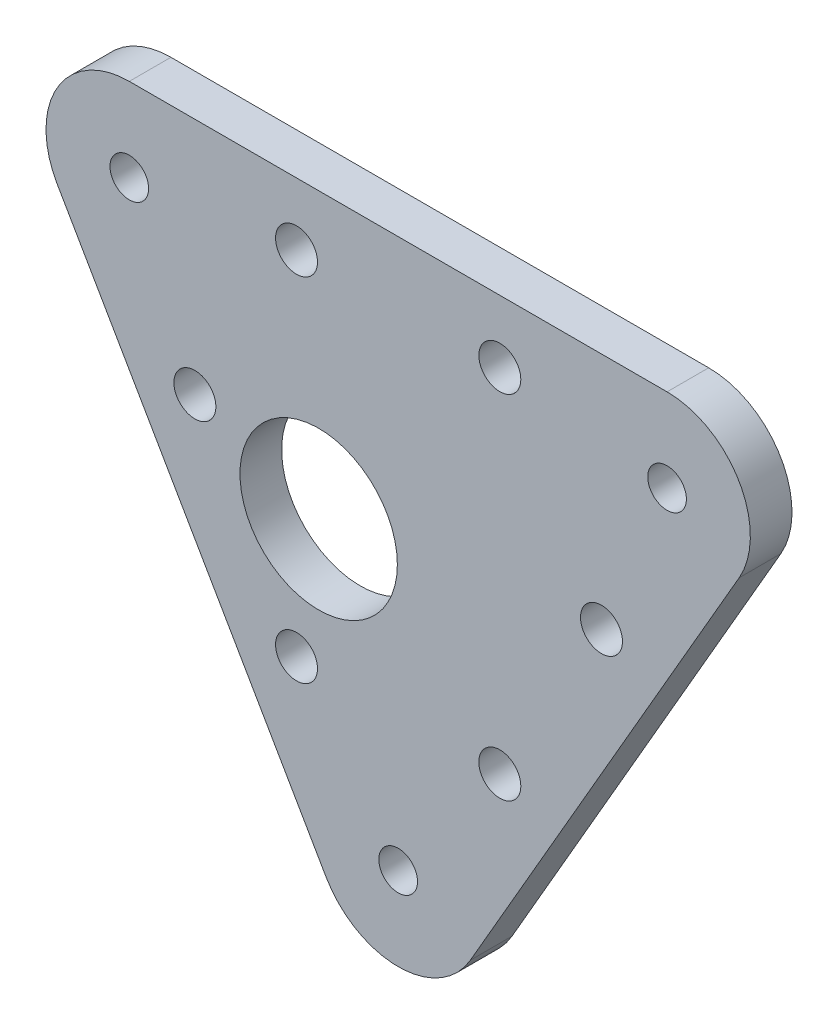
ISO-10303-21;
HEADER;
FILE_DESCRIPTION(('STEP AP214'),'2;1');
FILE_NAME('part.step','',(''),(''),'','','');
FILE_SCHEMA(('AUTOMOTIVE_DESIGN { 1 0 10303 214 1 1 1 1 }'));
ENDSEC;
DATA;
#1=APPLICATION_CONTEXT('core data for automotive mechanical design processes');
#2=APPLICATION_PROTOCOL_DEFINITION('international standard','automotive_design',2000,#1);
#3=PRODUCT_CONTEXT('',#1,'mechanical');
#4=PRODUCT('Part','Part','',(#3));
#5=PRODUCT_RELATED_PRODUCT_CATEGORY('part','',(#4));
#6=PRODUCT_DEFINITION_FORMATION('','',#4);
#7=PRODUCT_DEFINITION_CONTEXT('part definition',#1,'design');
#8=PRODUCT_DEFINITION('design','',#6,#7);
#9=PRODUCT_DEFINITION_SHAPE('','',#8);
#10=(LENGTH_UNIT() NAMED_UNIT(*) SI_UNIT(.MILLI.,.METRE.));
#11=(NAMED_UNIT(*) PLANE_ANGLE_UNIT() SI_UNIT($,.RADIAN.));
#12=(NAMED_UNIT(*) SI_UNIT($,.STERADIAN.) SOLID_ANGLE_UNIT());
#13=UNCERTAINTY_MEASURE_WITH_UNIT(LENGTH_MEASURE(1.E-05),#10,'distance_accuracy_value','');
#14=(GEOMETRIC_REPRESENTATION_CONTEXT(3) GLOBAL_UNCERTAINTY_ASSIGNED_CONTEXT((#13)) GLOBAL_UNIT_ASSIGNED_CONTEXT((#10,
#11,#12)) REPRESENTATION_CONTEXT('',''));
#15=CARTESIAN_POINT('',(0.,0.,0.));
#16=DIRECTION('',(0.,0.,1.));
#17=DIRECTION('',(1.,0.,0.));
#18=AXIS2_PLACEMENT_3D('',#15,#16,#17);
#19=CARTESIAN_POINT('',(31.4988919710468,18.1858937586588,3.175));
#20=DIRECTION('',(0.,0.,-1.));
#21=DIRECTION('',(-1.,0.,0.));
#22=AXIS2_PLACEMENT_3D('',#19,#20,#21);
#23=PLANE('',#22);
#24=CARTESIAN_POINT('',(-20.5003693429844,11.8358937586588,3.175));
#25=DIRECTION('',(0.,0.,1.));
#26=DIRECTION('',(1.,0.,0.));
#27=AXIS2_PLACEMENT_3D('',#24,#25,#26);
#28=CIRCLE('',#27,1.47319999999999);
#29=CARTESIAN_POINT('',(-19.0271693429844,11.8358937586588,3.175));
#30=VERTEX_POINT('',#29);
#31=EDGE_CURVE('E151',#30,#30,#28,.T.);
#32=ORIENTED_EDGE('',*,*,#31,.F.);
#33=EDGE_LOOP('',(#32));
#34=FACE_BOUND('',#33,.T.);
#35=CARTESIAN_POINT('',(20.5003693429844,11.8358937586588,3.175));
#36=DIRECTION('',(0.,0.,1.));
#37=DIRECTION('',(1.,0.,0.));
#38=AXIS2_PLACEMENT_3D('',#35,#36,#37);
#39=CIRCLE('',#38,1.47319999999999);
#40=CARTESIAN_POINT('',(21.9735693429844,11.8358937586588,3.175));
#41=VERTEX_POINT('',#40);
#42=EDGE_CURVE('E141',#41,#41,#39,.T.);
#43=ORIENTED_EDGE('',*,*,#42,.F.);
#44=EDGE_LOOP('',(#43));
#45=FACE_BOUND('',#44,.T.);
#46=CARTESIAN_POINT('',(-1.70002900645727E-13,-23.6717875173176,3.175));
#47=DIRECTION('',(0.,0.,1.));
#48=DIRECTION('',(1.,0.,0.));
#49=AXIS2_PLACEMENT_3D('',#46,#47,#48);
#50=CIRCLE('',#49,1.47319999999999);
#51=CARTESIAN_POINT('',(1.47319999999982,-23.6717875173176,3.175));
#52=VERTEX_POINT('',#51);
#53=EDGE_CURVE('E138',#52,#52,#50,.T.);
#54=ORIENTED_EDGE('',*,*,#53,.F.);
#55=EDGE_LOOP('',(#54));
#56=FACE_BOUND('',#55,.T.);
#57=CARTESIAN_POINT('',(-7.74999999999992,13.4233937586588,3.175));
#58=DIRECTION('',(0.,0.,1.));
#59=DIRECTION('',(1.,0.,0.));
#60=AXIS2_PLACEMENT_3D('',#57,#58,#59);
#61=CIRCLE('',#60,1.59999999999999);
#62=CARTESIAN_POINT('',(-6.14999999999993,13.4233937586588,3.175));
#63=VERTEX_POINT('',#62);
#64=EDGE_CURVE('E137',#63,#63,#61,.T.);
#65=ORIENTED_EDGE('',*,*,#64,.F.);
#66=EDGE_LOOP('',(#65));
#67=FACE_BOUND('',#66,.T.);
#68=CARTESIAN_POINT('',(7.75000000000008,13.4233937586588,3.175));
#69=DIRECTION('',(0.,0.,1.));
#70=DIRECTION('',(1.,0.,0.));
#71=AXIS2_PLACEMENT_3D('',#68,#69,#70);
#72=CIRCLE('',#71,1.59999999999999);
#73=CARTESIAN_POINT('',(9.35000000000007,13.4233937586588,3.175));
#74=VERTEX_POINT('',#73);
#75=EDGE_CURVE('E159',#74,#74,#72,.T.);
#76=ORIENTED_EDGE('',*,*,#75,.F.);
#77=EDGE_LOOP('',(#76));
#78=FACE_BOUND('',#77,.T.);
#79=CARTESIAN_POINT('',(15.5,0.,3.175));
#80=DIRECTION('',(0.,0.,1.));
#81=DIRECTION('',(1.,0.,0.));
#82=AXIS2_PLACEMENT_3D('',#79,#80,#81);
#83=CIRCLE('',#82,1.59999999999999);
#84=CARTESIAN_POINT('',(17.1,0.,3.175));
#85=VERTEX_POINT('',#84);
#86=EDGE_CURVE('E165',#85,#85,#83,.T.);
#87=ORIENTED_EDGE('',*,*,#86,.F.);
#88=EDGE_LOOP('',(#87));
#89=FACE_BOUND('',#88,.T.);
#90=CARTESIAN_POINT('',(-15.5,0.,3.175));
#91=DIRECTION('',(0.,0.,1.));
#92=DIRECTION('',(1.,0.,0.));
#93=AXIS2_PLACEMENT_3D('',#90,#91,#92);
#94=CIRCLE('',#93,1.59999999999999);
#95=CARTESIAN_POINT('',(-13.9,0.,3.175));
#96=VERTEX_POINT('',#95);
#97=EDGE_CURVE('E171',#96,#96,#94,.T.);
#98=ORIENTED_EDGE('',*,*,#97,.F.);
#99=EDGE_LOOP('',(#98));
#100=FACE_BOUND('',#99,.T.);
#101=CARTESIAN_POINT('',(-7.75000000000008,-13.4233937586588,3.175));
#102=DIRECTION('',(0.,0.,1.));
#103=DIRECTION('',(1.,0.,0.));
#104=AXIS2_PLACEMENT_3D('',#101,#102,#103);
#105=CIRCLE('',#104,1.59999999999999);
#106=CARTESIAN_POINT('',(-6.1500000000001,-13.4233937586588,3.175));
#107=VERTEX_POINT('',#106);
#108=EDGE_CURVE('E177',#107,#107,#105,.T.);
#109=ORIENTED_EDGE('',*,*,#108,.F.);
#110=EDGE_LOOP('',(#109));
#111=FACE_BOUND('',#110,.T.);
#112=CARTESIAN_POINT('',(7.74999999999992,-13.4233937586588,3.175));
#113=DIRECTION('',(0.,0.,1.));
#114=DIRECTION('',(1.,0.,0.));
#115=AXIS2_PLACEMENT_3D('',#112,#113,#114);
#116=CIRCLE('',#115,1.59999999999999);
#117=CARTESIAN_POINT('',(9.34999999999991,-13.4233937586588,3.175));
#118=VERTEX_POINT('',#117);
#119=EDGE_CURVE('E183',#118,#118,#116,.T.);
#120=ORIENTED_EDGE('',*,*,#119,.F.);
#121=EDGE_LOOP('',(#120));
#122=FACE_BOUND('',#121,.T.);
#123=DIRECTION('',(0.499999999999997,-0.86602540378444,0.));
#124=VECTOR('',#123,1.);
#125=CARTESIAN_POINT('',(-31.4988919710467,18.1858937586588,3.175));
#126=LINE('',#125,#124);
#127=CARTESIAN_POINT('',(-25.9996306570156,8.66089375865878,3.175));
#128=VERTEX_POINT('',#127);
#129=CARTESIAN_POINT('',(-5.49926131403138,-26.8467875173176,3.175));
#130=VERTEX_POINT('',#129);
#131=EDGE_CURVE('E117',#128,#130,#126,.T.);
#132=ORIENTED_EDGE('',*,*,#131,.T.);
#133=CARTESIAN_POINT('',(-1.70002900645727E-13,-23.6717875173176,3.175));
#134=DIRECTION('',(0.,0.,-1.));
#135=DIRECTION('',(-1.,0.,0.));
#136=AXIS2_PLACEMENT_3D('',#133,#134,#135);
#137=CIRCLE('',#136,6.35);
#138=CARTESIAN_POINT('',(5.49926131403101,-26.8467875173176,3.175));
#139=VERTEX_POINT('',#138);
#140=EDGE_CURVE('E132',#130,#139,#137,.F.);
#141=ORIENTED_EDGE('',*,*,#140,.T.);
#142=DIRECTION('',(0.500000000000003,0.866025403784437,0.));
#143=VECTOR('',#142,1.);
#144=CARTESIAN_POINT('',(31.4988919710468,18.1858937586588,3.175));
#145=LINE('',#144,#143);
#146=CARTESIAN_POINT('',(25.9996306570155,8.66089375865874,3.175));
#147=VERTEX_POINT('',#146);
#148=EDGE_CURVE('E107',#139,#147,#145,.T.);
#149=ORIENTED_EDGE('',*,*,#148,.T.);
#150=CARTESIAN_POINT('',(20.5003693429844,11.8358937586588,3.175));
#151=DIRECTION('',(0.,0.,-1.));
#152=DIRECTION('',(-1.,0.,0.));
#153=AXIS2_PLACEMENT_3D('',#150,#151,#152);
#154=CIRCLE('',#153,6.35);
#155=CARTESIAN_POINT('',(20.5003693429844,18.1858937586588,3.175));
#156=VERTEX_POINT('',#155);
#157=EDGE_CURVE('E55',#147,#156,#154,.F.);
#158=ORIENTED_EDGE('',*,*,#157,.T.);
#159=DIRECTION('',(-1.,0.,0.));
#160=VECTOR('',#159,1.);
#161=CARTESIAN_POINT('',(-31.4988919710467,18.1858937586588,3.175));
#162=LINE('',#161,#160);
#163=CARTESIAN_POINT('',(-20.5003693429844,18.1858937586588,3.175));
#164=VERTEX_POINT('',#163);
#165=EDGE_CURVE('E114',#156,#164,#162,.T.);
#166=ORIENTED_EDGE('',*,*,#165,.T.);
#167=CARTESIAN_POINT('',(-20.5003693429844,11.8358937586588,3.175));
#168=DIRECTION('',(0.,0.,-1.));
#169=DIRECTION('',(-1.,0.,0.));
#170=AXIS2_PLACEMENT_3D('',#167,#168,#169);
#171=CIRCLE('',#170,6.35);
#172=EDGE_CURVE('E129',#164,#128,#171,.F.);
#173=ORIENTED_EDGE('',*,*,#172,.T.);
#174=EDGE_LOOP('',(#132,#141,#149,#158,#166,#173));
#175=FACE_BOUND('',#174,.T.);
#176=CARTESIAN_POINT('',(-6.06217782649109,-3.49999999999996,3.175));
#177=DIRECTION('',(0.,0.,1.));
#178=DIRECTION('',(1.,0.,0.));
#179=AXIS2_PLACEMENT_3D('',#176,#177,#178);
#180=CIRCLE('',#179,6.);
#181=CARTESIAN_POINT('',(-0.0621778264910892,-3.49999999999996,3.175));
#182=VERTEX_POINT('',#181);
#183=EDGE_CURVE('E190',#182,#182,#180,.T.);
#184=ORIENTED_EDGE('',*,*,#183,.F.);
#185=EDGE_LOOP('',(#184));
#186=FACE_BOUND('',#185,.T.);
#187=ADVANCED_FACE('F32',(#34,#45,#56,#67,#78,#89,#100,#111,#122,#175,#186),#23,.F.);
#188=CARTESIAN_POINT('',(31.4988919710468,18.1858937586588,0.));
#189=DIRECTION('',(0.,0.,-1.));
#190=DIRECTION('',(-1.,0.,0.));
#191=AXIS2_PLACEMENT_3D('',#188,#189,#190);
#192=PLANE('',#191);
#193=CARTESIAN_POINT('',(-20.5003693429844,11.8358937586588,0.));
#194=DIRECTION('',(0.,0.,-1.));
#195=DIRECTION('',(-1.,0.,0.));
#196=AXIS2_PLACEMENT_3D('',#193,#194,#195);
#197=CIRCLE('',#196,1.47319999999999);
#198=CARTESIAN_POINT('',(-21.9735693429844,11.8358937586588,0.));
#199=VERTEX_POINT('',#198);
#200=EDGE_CURVE('E36',#199,#199,#197,.T.);
#201=ORIENTED_EDGE('',*,*,#200,.F.);
#202=EDGE_LOOP('',(#201));
#203=FACE_BOUND('',#202,.T.);
#204=CARTESIAN_POINT('',(20.5003693429844,11.8358937586588,0.));
#205=DIRECTION('',(0.,0.,-1.));
#206=DIRECTION('',(-1.,0.,0.));
#207=AXIS2_PLACEMENT_3D('',#204,#205,#206);
#208=CIRCLE('',#207,1.47319999999999);
#209=CARTESIAN_POINT('',(19.0271693429844,11.8358937586588,0.));
#210=VERTEX_POINT('',#209);
#211=EDGE_CURVE('E139',#210,#210,#208,.T.);
#212=ORIENTED_EDGE('',*,*,#211,.F.);
#213=EDGE_LOOP('',(#212));
#214=FACE_BOUND('',#213,.T.);
#215=CARTESIAN_POINT('',(-1.70002900645727E-13,-23.6717875173176,0.));
#216=DIRECTION('',(0.,0.,-1.));
#217=DIRECTION('',(-1.,0.,0.));
#218=AXIS2_PLACEMENT_3D('',#215,#216,#217);
#219=CIRCLE('',#218,1.47319999999999);
#220=CARTESIAN_POINT('',(-1.47320000000016,-23.6717875173176,0.));
#221=VERTEX_POINT('',#220);
#222=EDGE_CURVE('E135',#221,#221,#219,.T.);
#223=ORIENTED_EDGE('',*,*,#222,.F.);
#224=EDGE_LOOP('',(#223));
#225=FACE_BOUND('',#224,.T.);
#226=CARTESIAN_POINT('',(-7.74999999999992,13.4233937586588,1.18221404887819E-12));
#227=DIRECTION('',(0.,0.,1.));
#228=DIRECTION('',(1.,0.,0.));
#229=AXIS2_PLACEMENT_3D('',#226,#227,#228);
#230=CIRCLE('',#229,1.6);
#231=CARTESIAN_POINT('',(-6.14999999999992,13.4233937586588,1.18221404887819E-12));
#232=VERTEX_POINT('',#231);
#233=EDGE_CURVE('E156',#232,#232,#230,.T.);
#234=ORIENTED_EDGE('',*,*,#233,.T.);
#235=EDGE_LOOP('',(#234));
#236=FACE_BOUND('',#235,.T.);
#237=CARTESIAN_POINT('',(7.75000000000008,13.4233937586588,1.18221404887819E-12));
#238=DIRECTION('',(0.,0.,1.));
#239=DIRECTION('',(1.,0.,0.));
#240=AXIS2_PLACEMENT_3D('',#237,#238,#239);
#241=CIRCLE('',#240,1.6);
#242=CARTESIAN_POINT('',(9.35000000000008,13.4233937586588,1.18221404887819E-12));
#243=VERTEX_POINT('',#242);
#244=EDGE_CURVE('E162',#243,#243,#241,.T.);
#245=ORIENTED_EDGE('',*,*,#244,.T.);
#246=EDGE_LOOP('',(#245));
#247=FACE_BOUND('',#246,.T.);
#248=CARTESIAN_POINT('',(15.5,0.,1.18221404887819E-12));
#249=DIRECTION('',(0.,0.,1.));
#250=DIRECTION('',(1.,0.,0.));
#251=AXIS2_PLACEMENT_3D('',#248,#249,#250);
#252=CIRCLE('',#251,1.6);
#253=CARTESIAN_POINT('',(17.1,0.,1.18221404887819E-12));
#254=VERTEX_POINT('',#253);
#255=EDGE_CURVE('E168',#254,#254,#252,.T.);
#256=ORIENTED_EDGE('',*,*,#255,.T.);
#257=EDGE_LOOP('',(#256));
#258=FACE_BOUND('',#257,.T.);
#259=CARTESIAN_POINT('',(-15.5,0.,1.18221404887819E-12));
#260=DIRECTION('',(0.,0.,1.));
#261=DIRECTION('',(1.,0.,0.));
#262=AXIS2_PLACEMENT_3D('',#259,#260,#261);
#263=CIRCLE('',#262,1.6);
#264=CARTESIAN_POINT('',(-13.9,0.,1.18221404887819E-12));
#265=VERTEX_POINT('',#264);
#266=EDGE_CURVE('E174',#265,#265,#263,.T.);
#267=ORIENTED_EDGE('',*,*,#266,.T.);
#268=EDGE_LOOP('',(#267));
#269=FACE_BOUND('',#268,.T.);
#270=CARTESIAN_POINT('',(-7.75000000000008,-13.4233937586588,1.18221404887819E-12));
#271=DIRECTION('',(0.,0.,1.));
#272=DIRECTION('',(1.,0.,0.));
#273=AXIS2_PLACEMENT_3D('',#270,#271,#272);
#274=CIRCLE('',#273,1.6);
#275=CARTESIAN_POINT('',(-6.15000000000008,-13.4233937586588,1.18221404887819E-12));
#276=VERTEX_POINT('',#275);
#277=EDGE_CURVE('E180',#276,#276,#274,.T.);
#278=ORIENTED_EDGE('',*,*,#277,.T.);
#279=EDGE_LOOP('',(#278));
#280=FACE_BOUND('',#279,.T.);
#281=CARTESIAN_POINT('',(7.74999999999992,-13.4233937586588,1.18221404887819E-12));
#282=DIRECTION('',(0.,0.,1.));
#283=DIRECTION('',(1.,0.,0.));
#284=AXIS2_PLACEMENT_3D('',#281,#282,#283);
#285=CIRCLE('',#284,1.6);
#286=CARTESIAN_POINT('',(9.34999999999992,-13.4233937586588,1.18221404887819E-12));
#287=VERTEX_POINT('',#286);
#288=EDGE_CURVE('E186',#287,#287,#285,.T.);
#289=ORIENTED_EDGE('',*,*,#288,.T.);
#290=EDGE_LOOP('',(#289));
#291=FACE_BOUND('',#290,.T.);
#292=DIRECTION('',(0.500000000000003,0.866025403784437,0.));
#293=VECTOR('',#292,1.);
#294=CARTESIAN_POINT('',(31.4988919710468,18.1858937586588,0.));
#295=LINE('',#294,#293);
#296=CARTESIAN_POINT('',(5.49926131403101,-26.8467875173176,0.));
#297=VERTEX_POINT('',#296);
#298=CARTESIAN_POINT('',(25.9996306570155,8.66089375865874,0.));
#299=VERTEX_POINT('',#298);
#300=EDGE_CURVE('E105',#297,#299,#295,.T.);
#301=ORIENTED_EDGE('',*,*,#300,.F.);
#302=CARTESIAN_POINT('',(-1.70002900645727E-13,-23.6717875173176,0.));
#303=DIRECTION('',(0.,0.,-1.));
#304=DIRECTION('',(-1.,0.,0.));
#305=AXIS2_PLACEMENT_3D('',#302,#303,#304);
#306=CIRCLE('',#305,6.35);
#307=CARTESIAN_POINT('',(-5.49926131403138,-26.8467875173176,0.));
#308=VERTEX_POINT('',#307);
#309=EDGE_CURVE('E88',#297,#308,#306,.T.);
#310=ORIENTED_EDGE('',*,*,#309,.T.);
#311=DIRECTION('',(0.499999999999997,-0.86602540378444,0.));
#312=VECTOR('',#311,1.);
#313=CARTESIAN_POINT('',(-31.4988919710467,18.1858937586588,0.));
#314=LINE('',#313,#312);
#315=CARTESIAN_POINT('',(-25.9996306570156,8.66089375865878,0.));
#316=VERTEX_POINT('',#315);
#317=EDGE_CURVE('E115',#316,#308,#314,.T.);
#318=ORIENTED_EDGE('',*,*,#317,.F.);
#319=CARTESIAN_POINT('',(-20.5003693429844,11.8358937586588,0.));
#320=DIRECTION('',(0.,0.,-1.));
#321=DIRECTION('',(-1.,0.,0.));
#322=AXIS2_PLACEMENT_3D('',#319,#320,#321);
#323=CIRCLE('',#322,6.35);
#324=CARTESIAN_POINT('',(-20.5003693429844,18.1858937586588,0.));
#325=VERTEX_POINT('',#324);
#326=EDGE_CURVE('E108',#316,#325,#323,.T.);
#327=ORIENTED_EDGE('',*,*,#326,.T.);
#328=DIRECTION('',(-1.,0.,0.));
#329=VECTOR('',#328,1.);
#330=CARTESIAN_POINT('',(-31.4988919710467,18.1858937586588,0.));
#331=LINE('',#330,#329);
#332=CARTESIAN_POINT('',(20.5003693429844,18.1858937586588,0.));
#333=VERTEX_POINT('',#332);
#334=EDGE_CURVE('E119',#333,#325,#331,.T.);
#335=ORIENTED_EDGE('',*,*,#334,.F.);
#336=CARTESIAN_POINT('',(20.5003693429844,11.8358937586588,0.));
#337=DIRECTION('',(0.,0.,-1.));
#338=DIRECTION('',(-1.,0.,0.));
#339=AXIS2_PLACEMENT_3D('',#336,#337,#338);
#340=CIRCLE('',#339,6.35);
#341=EDGE_CURVE('E99',#333,#299,#340,.T.);
#342=ORIENTED_EDGE('',*,*,#341,.T.);
#343=EDGE_LOOP('',(#301,#310,#318,#327,#335,#342));
#344=FACE_BOUND('',#343,.T.);
#345=CARTESIAN_POINT('',(-6.06217782649109,-3.49999999999996,0.));
#346=DIRECTION('',(0.,0.,1.));
#347=DIRECTION('',(1.,0.,0.));
#348=AXIS2_PLACEMENT_3D('',#345,#346,#347);
#349=CIRCLE('',#348,6.);
#350=CARTESIAN_POINT('',(-0.0621778264910892,-3.49999999999996,0.));
#351=VERTEX_POINT('',#350);
#352=EDGE_CURVE('E189',#351,#351,#349,.T.);
#353=ORIENTED_EDGE('',*,*,#352,.T.);
#354=EDGE_LOOP('',(#353));
#355=FACE_BOUND('',#354,.T.);
#356=ADVANCED_FACE('F111',(#203,#214,#225,#236,#247,#258,#269,#280,#291,#344,#355),#192,.T.);
#357=CARTESIAN_POINT('',(-31.4988919710467,18.1858937586588,3.175));
#358=DIRECTION('',(0.,-1.,0.));
#359=DIRECTION('',(0.,0.,-1.));
#360=AXIS2_PLACEMENT_3D('',#357,#358,#359);
#361=PLANE('',#360);
#362=ORIENTED_EDGE('',*,*,#165,.F.);
#363=DIRECTION('',(0.,0.,-1.));
#364=VECTOR('',#363,1.);
#365=CARTESIAN_POINT('',(20.5003693429844,18.1858937586588,3.175));
#366=LINE('',#365,#364);
#367=EDGE_CURVE('E11',#156,#333,#366,.T.);
#368=ORIENTED_EDGE('',*,*,#367,.T.);
#369=ORIENTED_EDGE('',*,*,#334,.T.);
#370=DIRECTION('',(0.,0.,-1.));
#371=VECTOR('',#370,1.);
#372=CARTESIAN_POINT('',(-20.5003693429844,18.1858937586588,3.175));
#373=LINE('',#372,#371);
#374=EDGE_CURVE('E41',#325,#164,#373,.F.);
#375=ORIENTED_EDGE('',*,*,#374,.T.);
#376=EDGE_LOOP('',(#362,#368,#369,#375));
#377=FACE_BOUND('',#376,.T.);
#378=ADVANCED_FACE('F197',(#377),#361,.F.);
#379=CARTESIAN_POINT('',(-31.4988919710467,18.1858937586588,3.175));
#380=DIRECTION('',(0.866025403784441,0.499999999999997,0.));
#381=DIRECTION('',(-0.499999999999997,0.86602540378444,0.));
#382=AXIS2_PLACEMENT_3D('',#379,#380,#381);
#383=PLANE('',#382);
#384=ORIENTED_EDGE('',*,*,#317,.T.);
#385=DIRECTION('',(0.,0.,-1.));
#386=VECTOR('',#385,1.);
#387=CARTESIAN_POINT('',(-5.49926131403136,-26.8467875173176,3.175));
#388=LINE('',#387,#386);
#389=EDGE_CURVE('E93',#308,#130,#388,.F.);
#390=ORIENTED_EDGE('',*,*,#389,.T.);
#391=ORIENTED_EDGE('',*,*,#131,.F.);
#392=DIRECTION('',(0.,0.,-1.));
#393=VECTOR('',#392,1.);
#394=CARTESIAN_POINT('',(-25.9996306570156,8.66089375865878,3.175));
#395=LINE('',#394,#393);
#396=EDGE_CURVE('E98',#128,#316,#395,.T.);
#397=ORIENTED_EDGE('',*,*,#396,.T.);
#398=EDGE_LOOP('',(#384,#390,#391,#397));
#399=FACE_BOUND('',#398,.T.);
#400=ADVANCED_FACE('F205',(#399),#383,.F.);
#401=CARTESIAN_POINT('',(31.4988919710468,18.1858937586588,3.175));
#402=DIRECTION('',(-0.866025403784437,0.500000000000003,0.));
#403=DIRECTION('',(-0.500000000000003,-0.866025403784437,0.));
#404=AXIS2_PLACEMENT_3D('',#401,#402,#403);
#405=PLANE('',#404);
#406=ORIENTED_EDGE('',*,*,#148,.F.);
#407=DIRECTION('',(0.,0.,-1.));
#408=VECTOR('',#407,1.);
#409=CARTESIAN_POINT('',(5.49926131403101,-26.8467875173176,3.175));
#410=LINE('',#409,#408);
#411=EDGE_CURVE('E92',#139,#297,#410,.T.);
#412=ORIENTED_EDGE('',*,*,#411,.T.);
#413=ORIENTED_EDGE('',*,*,#300,.T.);
#414=DIRECTION('',(0.,0.,-1.));
#415=VECTOR('',#414,1.);
#416=CARTESIAN_POINT('',(25.9996306570155,8.66089375865874,3.175));
#417=LINE('',#416,#415);
#418=EDGE_CURVE('E109',#299,#147,#417,.F.);
#419=ORIENTED_EDGE('',*,*,#418,.T.);
#420=EDGE_LOOP('',(#406,#412,#413,#419));
#421=FACE_BOUND('',#420,.T.);
#422=ADVANCED_FACE('F104',(#421),#405,.F.);
#423=CARTESIAN_POINT('',(-6.06217782649109,-3.49999999999996,3.175));
#424=DIRECTION('',(0.,0.,-1.));
#425=DIRECTION('',(-1.,0.,0.));
#426=AXIS2_PLACEMENT_3D('',#423,#424,#425);
#427=CYLINDRICAL_SURFACE('',#426,6.);
#428=ORIENTED_EDGE('',*,*,#183,.T.);
#429=EDGE_LOOP('',(#428));
#430=FACE_BOUND('',#429,.T.);
#431=ORIENTED_EDGE('',*,*,#352,.F.);
#432=EDGE_LOOP('',(#431));
#433=FACE_BOUND('',#432,.T.);
#434=ADVANCED_FACE('F212',(#430,#433),#427,.F.);
#435=CARTESIAN_POINT('',(7.74999999999992,-13.4233937586588,3.175));
#436=DIRECTION('',(0.,0.,1.));
#437=DIRECTION('',(1.,0.,0.));
#438=AXIS2_PLACEMENT_3D('',#435,#436,#437);
#439=CYLINDRICAL_SURFACE('',#438,1.59999999999999);
#440=ORIENTED_EDGE('',*,*,#288,.F.);
#441=EDGE_LOOP('',(#440));
#442=FACE_BOUND('',#441,.T.);
#443=ORIENTED_EDGE('',*,*,#119,.T.);
#444=EDGE_LOOP('',(#443));
#445=FACE_BOUND('',#444,.T.);
#446=ADVANCED_FACE('F228',(#442,#445),#439,.F.);
#447=CARTESIAN_POINT('',(-7.75000000000008,-13.4233937586588,3.175));
#448=DIRECTION('',(0.,0.,1.));
#449=DIRECTION('',(1.,0.,0.));
#450=AXIS2_PLACEMENT_3D('',#447,#448,#449);
#451=CYLINDRICAL_SURFACE('',#450,1.59999999999999);
#452=ORIENTED_EDGE('',*,*,#277,.F.);
#453=EDGE_LOOP('',(#452));
#454=FACE_BOUND('',#453,.T.);
#455=ORIENTED_EDGE('',*,*,#108,.T.);
#456=EDGE_LOOP('',(#455));
#457=FACE_BOUND('',#456,.T.);
#458=ADVANCED_FACE('F232',(#454,#457),#451,.F.);
#459=CARTESIAN_POINT('',(-15.5,0.,3.175));
#460=DIRECTION('',(0.,0.,1.));
#461=DIRECTION('',(1.,0.,0.));
#462=AXIS2_PLACEMENT_3D('',#459,#460,#461);
#463=CYLINDRICAL_SURFACE('',#462,1.59999999999999);
#464=ORIENTED_EDGE('',*,*,#266,.F.);
#465=EDGE_LOOP('',(#464));
#466=FACE_BOUND('',#465,.T.);
#467=ORIENTED_EDGE('',*,*,#97,.T.);
#468=EDGE_LOOP('',(#467));
#469=FACE_BOUND('',#468,.T.);
#470=ADVANCED_FACE('F236',(#466,#469),#463,.F.);
#471=CARTESIAN_POINT('',(15.5,0.,3.175));
#472=DIRECTION('',(0.,0.,1.));
#473=DIRECTION('',(1.,0.,0.));
#474=AXIS2_PLACEMENT_3D('',#471,#472,#473);
#475=CYLINDRICAL_SURFACE('',#474,1.59999999999999);
#476=ORIENTED_EDGE('',*,*,#255,.F.);
#477=EDGE_LOOP('',(#476));
#478=FACE_BOUND('',#477,.T.);
#479=ORIENTED_EDGE('',*,*,#86,.T.);
#480=EDGE_LOOP('',(#479));
#481=FACE_BOUND('',#480,.T.);
#482=ADVANCED_FACE('F240',(#478,#481),#475,.F.);
#483=CARTESIAN_POINT('',(7.75000000000008,13.4233937586588,3.175));
#484=DIRECTION('',(0.,0.,1.));
#485=DIRECTION('',(1.,0.,0.));
#486=AXIS2_PLACEMENT_3D('',#483,#484,#485);
#487=CYLINDRICAL_SURFACE('',#486,1.59999999999999);
#488=ORIENTED_EDGE('',*,*,#244,.F.);
#489=EDGE_LOOP('',(#488));
#490=FACE_BOUND('',#489,.T.);
#491=ORIENTED_EDGE('',*,*,#75,.T.);
#492=EDGE_LOOP('',(#491));
#493=FACE_BOUND('',#492,.T.);
#494=ADVANCED_FACE('F244',(#490,#493),#487,.F.);
#495=CARTESIAN_POINT('',(-7.74999999999992,13.4233937586588,3.175));
#496=DIRECTION('',(0.,0.,1.));
#497=DIRECTION('',(1.,0.,0.));
#498=AXIS2_PLACEMENT_3D('',#495,#496,#497);
#499=CYLINDRICAL_SURFACE('',#498,1.59999999999999);
#500=ORIENTED_EDGE('',*,*,#233,.F.);
#501=EDGE_LOOP('',(#500));
#502=FACE_BOUND('',#501,.T.);
#503=ORIENTED_EDGE('',*,*,#64,.T.);
#504=EDGE_LOOP('',(#503));
#505=FACE_BOUND('',#504,.T.);
#506=ADVANCED_FACE('F248',(#502,#505),#499,.F.);
#507=CARTESIAN_POINT('',(-1.70002900645727E-13,-23.6717875173176,3.175));
#508=DIRECTION('',(0.,0.,-1.));
#509=DIRECTION('',(-1.,0.,0.));
#510=AXIS2_PLACEMENT_3D('',#507,#508,#509);
#511=CYLINDRICAL_SURFACE('',#510,6.35);
#512=ORIENTED_EDGE('',*,*,#140,.F.);
#513=ORIENTED_EDGE('',*,*,#389,.F.);
#514=ORIENTED_EDGE('',*,*,#309,.F.);
#515=ORIENTED_EDGE('',*,*,#411,.F.);
#516=EDGE_LOOP('',(#512,#513,#514,#515));
#517=FACE_BOUND('',#516,.T.);
#518=ADVANCED_FACE('F91',(#517),#511,.T.);
#519=CARTESIAN_POINT('',(20.5003693429844,11.8358937586588,3.175));
#520=DIRECTION('',(0.,0.,-1.));
#521=DIRECTION('',(-1.,0.,0.));
#522=AXIS2_PLACEMENT_3D('',#519,#520,#521);
#523=CYLINDRICAL_SURFACE('',#522,6.35);
#524=ORIENTED_EDGE('',*,*,#157,.F.);
#525=ORIENTED_EDGE('',*,*,#418,.F.);
#526=ORIENTED_EDGE('',*,*,#341,.F.);
#527=ORIENTED_EDGE('',*,*,#367,.F.);
#528=EDGE_LOOP('',(#524,#525,#526,#527));
#529=FACE_BOUND('',#528,.T.);
#530=ADVANCED_FACE('F319',(#529),#523,.T.);
#531=CARTESIAN_POINT('',(-20.5003693429844,11.8358937586588,3.175));
#532=DIRECTION('',(0.,0.,-1.));
#533=DIRECTION('',(-1.,0.,0.));
#534=AXIS2_PLACEMENT_3D('',#531,#532,#533);
#535=CYLINDRICAL_SURFACE('',#534,6.35);
#536=ORIENTED_EDGE('',*,*,#172,.F.);
#537=ORIENTED_EDGE('',*,*,#374,.F.);
#538=ORIENTED_EDGE('',*,*,#326,.F.);
#539=ORIENTED_EDGE('',*,*,#396,.F.);
#540=EDGE_LOOP('',(#536,#537,#538,#539));
#541=FACE_BOUND('',#540,.T.);
#542=ADVANCED_FACE('F34',(#541),#535,.T.);
#543=CARTESIAN_POINT('',(-1.70002900645727E-13,-23.6717875173176,3.175));
#544=DIRECTION('',(0.,0.,1.));
#545=DIRECTION('',(1.,0.,0.));
#546=AXIS2_PLACEMENT_3D('',#543,#544,#545);
#547=CYLINDRICAL_SURFACE('',#546,1.47319999999999);
#548=ORIENTED_EDGE('',*,*,#222,.T.);
#549=EDGE_LOOP('',(#548));
#550=FACE_BOUND('',#549,.T.);
#551=ORIENTED_EDGE('',*,*,#53,.T.);
#552=EDGE_LOOP('',(#551));
#553=FACE_BOUND('',#552,.T.);
#554=ADVANCED_FACE('F253',(#550,#553),#547,.F.);
#555=CARTESIAN_POINT('',(20.5003693429844,11.8358937586588,3.175));
#556=DIRECTION('',(0.,0.,1.));
#557=DIRECTION('',(1.,0.,0.));
#558=AXIS2_PLACEMENT_3D('',#555,#556,#557);
#559=CYLINDRICAL_SURFACE('',#558,1.47319999999999);
#560=ORIENTED_EDGE('',*,*,#211,.T.);
#561=EDGE_LOOP('',(#560));
#562=FACE_BOUND('',#561,.T.);
#563=ORIENTED_EDGE('',*,*,#42,.T.);
#564=EDGE_LOOP('',(#563));
#565=FACE_BOUND('',#564,.T.);
#566=ADVANCED_FACE('F256',(#562,#565),#559,.F.);
#567=CARTESIAN_POINT('',(-20.5003693429844,11.8358937586588,3.175));
#568=DIRECTION('',(0.,0.,1.));
#569=DIRECTION('',(1.,0.,0.));
#570=AXIS2_PLACEMENT_3D('',#567,#568,#569);
#571=CYLINDRICAL_SURFACE('',#570,1.47319999999999);
#572=ORIENTED_EDGE('',*,*,#200,.T.);
#573=EDGE_LOOP('',(#572));
#574=FACE_BOUND('',#573,.T.);
#575=ORIENTED_EDGE('',*,*,#31,.T.);
#576=EDGE_LOOP('',(#575));
#577=FACE_BOUND('',#576,.T.);
#578=ADVANCED_FACE('F260',(#574,#577),#571,.F.);
#579=CLOSED_SHELL('',(#187,#356,#378,#400,#422,#434,#446,#458,#470,#482,#494,#506,#518,#530,
#542,#554,#566,#578));
#580=MANIFOLD_SOLID_BREP('B2',#579);
#581=ADVANCED_BREP_SHAPE_REPRESENTATION('',(#18,#580),#14);
#582=SHAPE_DEFINITION_REPRESENTATION(#9,#581);
ENDSEC;
END-ISO-10303-21;
